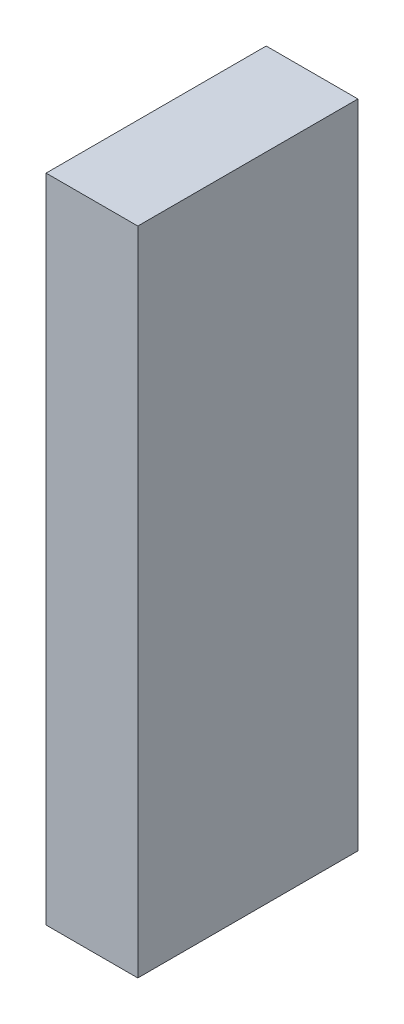
ISO-10303-21;
HEADER;
FILE_DESCRIPTION(('STEP AP214'),'2;1');
FILE_NAME('part.step','',(''),(''),'','','');
FILE_SCHEMA(('AUTOMOTIVE_DESIGN { 1 0 10303 214 1 1 1 1 }'));
ENDSEC;
DATA;
#1=APPLICATION_CONTEXT('core data for automotive mechanical design processes');
#2=APPLICATION_PROTOCOL_DEFINITION('international standard','automotive_design',2000,#1);
#3=PRODUCT_CONTEXT('',#1,'mechanical');
#4=PRODUCT('Part','Part','',(#3));
#5=PRODUCT_RELATED_PRODUCT_CATEGORY('part','',(#4));
#6=PRODUCT_DEFINITION_FORMATION('','',#4);
#7=PRODUCT_DEFINITION_CONTEXT('part definition',#1,'design');
#8=PRODUCT_DEFINITION('design','',#6,#7);
#9=PRODUCT_DEFINITION_SHAPE('','',#8);
#10=(LENGTH_UNIT() NAMED_UNIT(*) SI_UNIT(.MILLI.,.METRE.));
#11=(NAMED_UNIT(*) PLANE_ANGLE_UNIT() SI_UNIT($,.RADIAN.));
#12=(NAMED_UNIT(*) SI_UNIT($,.STERADIAN.) SOLID_ANGLE_UNIT());
#13=UNCERTAINTY_MEASURE_WITH_UNIT(LENGTH_MEASURE(1.E-05),#10,'distance_accuracy_value','');
#14=(GEOMETRIC_REPRESENTATION_CONTEXT(3) GLOBAL_UNCERTAINTY_ASSIGNED_CONTEXT((#13)) GLOBAL_UNIT_ASSIGNED_CONTEXT((#10,
#11,#12)) REPRESENTATION_CONTEXT('',''));
#15=CARTESIAN_POINT('',(0.,0.,0.));
#16=DIRECTION('',(0.,0.,1.));
#17=DIRECTION('',(1.,0.,0.));
#18=AXIS2_PLACEMENT_3D('',#15,#16,#17);
#19=CARTESIAN_POINT('',(0.,0.,0.));
#20=DIRECTION('',(-1.,0.,0.));
#21=DIRECTION('',(0.,0.,1.));
#22=AXIS2_PLACEMENT_3D('',#19,#20,#21);
#23=PLANE('',#22);
#24=DIRECTION('',(0.,0.,-1.));
#25=VECTOR('',#24,1.);
#26=CARTESIAN_POINT('',(0.,79.7999999999999,20.5));
#27=LINE('',#26,#25);
#28=CARTESIAN_POINT('',(0.,79.7999999999999,20.5));
#29=VERTEX_POINT('',#28);
#30=CARTESIAN_POINT('',(0.,79.7999999999999,-20.5));
#31=VERTEX_POINT('',#30);
#32=EDGE_CURVE('E55',#29,#31,#27,.T.);
#33=ORIENTED_EDGE('',*,*,#32,.F.);
#34=DIRECTION('',(0.,1.,0.));
#35=VECTOR('',#34,1.);
#36=CARTESIAN_POINT('',(0.,74.5999999999999,20.5));
#37=LINE('',#36,#35);
#38=CARTESIAN_POINT('',(0.,74.5999999999999,20.5));
#39=VERTEX_POINT('',#38);
#40=EDGE_CURVE('E136',#39,#29,#37,.T.);
#41=ORIENTED_EDGE('',*,*,#40,.F.);
#42=DIRECTION('',(0.,0.,1.));
#43=VECTOR('',#42,1.);
#44=CARTESIAN_POINT('',(0.,74.5999999999999,20.5));
#45=LINE('',#44,#43);
#46=CARTESIAN_POINT('',(0.,74.5999999999999,-20.5));
#47=VERTEX_POINT('',#46);
#48=EDGE_CURVE('E139',#47,#39,#45,.T.);
#49=ORIENTED_EDGE('',*,*,#48,.F.);
#50=DIRECTION('',(0.,-1.,0.));
#51=VECTOR('',#50,1.);
#52=CARTESIAN_POINT('',(0.,74.5999999999999,-20.5));
#53=LINE('',#52,#51);
#54=EDGE_CURVE('E145',#31,#47,#53,.T.);
#55=ORIENTED_EDGE('',*,*,#54,.F.);
#56=EDGE_LOOP('',(#33,#41,#49,#55));
#57=FACE_BOUND('',#56,.T.);
#58=CARTESIAN_POINT('',(0.,14.,-13.));
#59=DIRECTION('',(-1.,0.,0.));
#60=DIRECTION('',(0.,0.,1.));
#61=AXIS2_PLACEMENT_3D('',#58,#59,#60);
#62=CIRCLE('',#61,2.6);
#63=CARTESIAN_POINT('',(0.,14.,-10.4));
#64=VERTEX_POINT('',#63);
#65=EDGE_CURVE('E47',#64,#64,#62,.T.);
#66=ORIENTED_EDGE('',*,*,#65,.F.);
#67=EDGE_LOOP('',(#66));
#68=FACE_BOUND('',#67,.T.);
#69=CARTESIAN_POINT('',(0.,-13.9761892483413,-13.));
#70=DIRECTION('',(-1.,0.,0.));
#71=DIRECTION('',(0.,0.,1.));
#72=AXIS2_PLACEMENT_3D('',#69,#70,#71);
#73=CIRCLE('',#72,2.6);
#74=CARTESIAN_POINT('',(0.,-13.9761892483413,-10.4));
#75=VERTEX_POINT('',#74);
#76=EDGE_CURVE('E188',#75,#75,#73,.T.);
#77=ORIENTED_EDGE('',*,*,#76,.F.);
#78=EDGE_LOOP('',(#77));
#79=FACE_BOUND('',#78,.T.);
#80=CARTESIAN_POINT('',(0.,-13.9761892483413,13.));
#81=DIRECTION('',(-1.,0.,0.));
#82=DIRECTION('',(0.,0.,1.));
#83=AXIS2_PLACEMENT_3D('',#80,#81,#82);
#84=CIRCLE('',#83,2.6);
#85=CARTESIAN_POINT('',(0.,-13.9761892483413,15.6));
#86=VERTEX_POINT('',#85);
#87=EDGE_CURVE('E42',#86,#86,#84,.T.);
#88=ORIENTED_EDGE('',*,*,#87,.F.);
#89=EDGE_LOOP('',(#88));
#90=FACE_BOUND('',#89,.T.);
#91=CARTESIAN_POINT('',(0.,14.,13.));
#92=DIRECTION('',(-1.,0.,0.));
#93=DIRECTION('',(0.,0.,1.));
#94=AXIS2_PLACEMENT_3D('',#91,#92,#93);
#95=CIRCLE('',#94,2.6);
#96=CARTESIAN_POINT('',(0.,14.,15.6));
#97=VERTEX_POINT('',#96);
#98=EDGE_CURVE('E178',#97,#97,#95,.T.);
#99=ORIENTED_EDGE('',*,*,#98,.F.);
#100=EDGE_LOOP('',(#99));
#101=FACE_BOUND('',#100,.T.);
#102=DIRECTION('',(0.,0.,1.));
#103=VECTOR('',#102,1.);
#104=CARTESIAN_POINT('',(0.,110.509514535045,24.0000000000001));
#105=LINE('',#104,#103);
#106=CARTESIAN_POINT('',(0.,110.509514535045,-23.9999999999999));
#107=VERTEX_POINT('',#106);
#108=CARTESIAN_POINT('',(0.,110.509514535045,24.0000000000001));
#109=VERTEX_POINT('',#108);
#110=EDGE_CURVE('E169',#107,#109,#105,.T.);
#111=ORIENTED_EDGE('',*,*,#110,.F.);
#112=DIRECTION('',(0.,1.,0.));
#113=VECTOR('',#112,1.);
#114=CARTESIAN_POINT('',(0.,-31.5,-23.9999999999999));
#115=LINE('',#114,#113);
#116=CARTESIAN_POINT('',(0.,-31.5,-23.9999999999999));
#117=VERTEX_POINT('',#116);
#118=EDGE_CURVE('E92',#117,#107,#115,.T.);
#119=ORIENTED_EDGE('',*,*,#118,.F.);
#120=DIRECTION('',(0.,0.,-1.));
#121=VECTOR('',#120,1.);
#122=CARTESIAN_POINT('',(0.,-31.5,24.0000000000001));
#123=LINE('',#122,#121);
#124=CARTESIAN_POINT('',(0.,-31.5,24.0000000000001));
#125=VERTEX_POINT('',#124);
#126=EDGE_CURVE('E165',#125,#117,#123,.T.);
#127=ORIENTED_EDGE('',*,*,#126,.F.);
#128=DIRECTION('',(0.,-1.,0.));
#129=VECTOR('',#128,1.);
#130=CARTESIAN_POINT('',(0.,-31.5,24.0000000000001));
#131=LINE('',#130,#129);
#132=EDGE_CURVE('E64',#109,#125,#131,.T.);
#133=ORIENTED_EDGE('',*,*,#132,.F.);
#134=EDGE_LOOP('',(#111,#119,#127,#133));
#135=FACE_BOUND('',#134,.T.);
#136=ADVANCED_FACE('F39',(#57,#68,#79,#90,#101,#135),#23,.T.);
#137=CARTESIAN_POINT('',(16.,14.,-13.));
#138=DIRECTION('',(-1.,0.,0.));
#139=DIRECTION('',(0.,0.,1.));
#140=AXIS2_PLACEMENT_3D('',#137,#138,#139);
#141=PLANE('',#140);
#142=CARTESIAN_POINT('',(16.,14.,-13.));
#143=DIRECTION('',(-1.,0.,0.));
#144=DIRECTION('',(0.,0.,1.));
#145=AXIS2_PLACEMENT_3D('',#142,#143,#144);
#146=CIRCLE('',#145,2.6);
#147=CARTESIAN_POINT('',(16.,14.,-10.4));
#148=VERTEX_POINT('',#147);
#149=EDGE_CURVE('E11',#148,#148,#146,.T.);
#150=ORIENTED_EDGE('',*,*,#149,.T.);
#151=EDGE_LOOP('',(#150));
#152=FACE_BOUND('',#151,.T.);
#153=ADVANCED_FACE('F201',(#152),#141,.T.);
#154=CARTESIAN_POINT('',(16.,14.,-13.));
#155=DIRECTION('',(-1.,0.,0.));
#156=DIRECTION('',(0.,0.,1.));
#157=AXIS2_PLACEMENT_3D('',#154,#155,#156);
#158=CYLINDRICAL_SURFACE('',#157,2.6);
#159=ORIENTED_EDGE('',*,*,#149,.F.);
#160=EDGE_LOOP('',(#159));
#161=FACE_BOUND('',#160,.T.);
#162=ORIENTED_EDGE('',*,*,#65,.T.);
#163=EDGE_LOOP('',(#162));
#164=FACE_BOUND('',#163,.T.);
#165=ADVANCED_FACE('F228',(#161,#164),#158,.F.);
#166=CARTESIAN_POINT('',(16.,-13.9761892483413,-13.));
#167=DIRECTION('',(-1.,0.,0.));
#168=DIRECTION('',(0.,0.,1.));
#169=AXIS2_PLACEMENT_3D('',#166,#167,#168);
#170=PLANE('',#169);
#171=CARTESIAN_POINT('',(16.,-13.9761892483413,-13.));
#172=DIRECTION('',(-1.,0.,0.));
#173=DIRECTION('',(0.,0.,1.));
#174=AXIS2_PLACEMENT_3D('',#171,#172,#173);
#175=CIRCLE('',#174,2.6);
#176=CARTESIAN_POINT('',(16.,-13.9761892483413,-10.4));
#177=VERTEX_POINT('',#176);
#178=EDGE_CURVE('E185',#177,#177,#175,.T.);
#179=ORIENTED_EDGE('',*,*,#178,.T.);
#180=EDGE_LOOP('',(#179));
#181=FACE_BOUND('',#180,.T.);
#182=ADVANCED_FACE('F235',(#181),#170,.T.);
#183=CARTESIAN_POINT('',(16.,-13.9761892483413,-13.));
#184=DIRECTION('',(-1.,0.,0.));
#185=DIRECTION('',(0.,0.,1.));
#186=AXIS2_PLACEMENT_3D('',#183,#184,#185);
#187=CYLINDRICAL_SURFACE('',#186,2.6);
#188=ORIENTED_EDGE('',*,*,#178,.F.);
#189=EDGE_LOOP('',(#188));
#190=FACE_BOUND('',#189,.T.);
#191=ORIENTED_EDGE('',*,*,#76,.T.);
#192=EDGE_LOOP('',(#191));
#193=FACE_BOUND('',#192,.T.);
#194=ADVANCED_FACE('F244',(#190,#193),#187,.F.);
#195=CARTESIAN_POINT('',(16.,-13.9761892483413,13.));
#196=DIRECTION('',(-1.,0.,0.));
#197=DIRECTION('',(0.,0.,1.));
#198=AXIS2_PLACEMENT_3D('',#195,#196,#197);
#199=PLANE('',#198);
#200=CARTESIAN_POINT('',(16.,-13.9761892483413,13.));
#201=DIRECTION('',(-1.,0.,0.));
#202=DIRECTION('',(0.,0.,1.));
#203=AXIS2_PLACEMENT_3D('',#200,#201,#202);
#204=CIRCLE('',#203,2.6);
#205=CARTESIAN_POINT('',(16.,-13.9761892483413,15.6));
#206=VERTEX_POINT('',#205);
#207=EDGE_CURVE('E190',#206,#206,#204,.T.);
#208=ORIENTED_EDGE('',*,*,#207,.T.);
#209=EDGE_LOOP('',(#208));
#210=FACE_BOUND('',#209,.T.);
#211=ADVANCED_FACE('F248',(#210),#199,.T.);
#212=CARTESIAN_POINT('',(16.,-13.9761892483413,13.));
#213=DIRECTION('',(-1.,0.,0.));
#214=DIRECTION('',(0.,0.,1.));
#215=AXIS2_PLACEMENT_3D('',#212,#213,#214);
#216=CYLINDRICAL_SURFACE('',#215,2.6);
#217=ORIENTED_EDGE('',*,*,#207,.F.);
#218=EDGE_LOOP('',(#217));
#219=FACE_BOUND('',#218,.T.);
#220=ORIENTED_EDGE('',*,*,#87,.T.);
#221=EDGE_LOOP('',(#220));
#222=FACE_BOUND('',#221,.T.);
#223=ADVANCED_FACE('F197',(#219,#222),#216,.F.);
#224=CARTESIAN_POINT('',(16.,14.,13.));
#225=DIRECTION('',(-1.,0.,0.));
#226=DIRECTION('',(0.,0.,1.));
#227=AXIS2_PLACEMENT_3D('',#224,#225,#226);
#228=PLANE('',#227);
#229=CARTESIAN_POINT('',(16.,14.,13.));
#230=DIRECTION('',(-1.,0.,0.));
#231=DIRECTION('',(0.,0.,1.));
#232=AXIS2_PLACEMENT_3D('',#229,#230,#231);
#233=CIRCLE('',#232,2.6);
#234=CARTESIAN_POINT('',(16.,14.,15.6));
#235=VERTEX_POINT('',#234);
#236=EDGE_CURVE('E172',#235,#235,#233,.T.);
#237=ORIENTED_EDGE('',*,*,#236,.T.);
#238=EDGE_LOOP('',(#237));
#239=FACE_BOUND('',#238,.T.);
#240=ADVANCED_FACE('F239',(#239),#228,.T.);
#241=CARTESIAN_POINT('',(16.,14.,13.));
#242=DIRECTION('',(-1.,0.,0.));
#243=DIRECTION('',(0.,0.,1.));
#244=AXIS2_PLACEMENT_3D('',#241,#242,#243);
#245=CYLINDRICAL_SURFACE('',#244,2.6);
#246=ORIENTED_EDGE('',*,*,#236,.F.);
#247=EDGE_LOOP('',(#246));
#248=FACE_BOUND('',#247,.T.);
#249=ORIENTED_EDGE('',*,*,#98,.T.);
#250=EDGE_LOOP('',(#249));
#251=FACE_BOUND('',#250,.T.);
#252=ADVANCED_FACE('F225',(#248,#251),#245,.F.);
#253=CARTESIAN_POINT('',(20.,110.509514535045,24.0000000000001));
#254=DIRECTION('',(0.,-1.,0.));
#255=DIRECTION('',(0.,0.,-1.));
#256=AXIS2_PLACEMENT_3D('',#253,#254,#255);
#257=PLANE('',#256);
#258=ORIENTED_EDGE('',*,*,#110,.T.);
#259=DIRECTION('',(-1.,0.,0.));
#260=VECTOR('',#259,1.);
#261=CARTESIAN_POINT('',(20.,110.509514535045,24.0000000000001));
#262=LINE('',#261,#260);
#263=CARTESIAN_POINT('',(20.,110.509514535045,24.0000000000001));
#264=VERTEX_POINT('',#263);
#265=EDGE_CURVE('E151',#264,#109,#262,.T.);
#266=ORIENTED_EDGE('',*,*,#265,.F.);
#267=DIRECTION('',(0.,0.,1.));
#268=VECTOR('',#267,1.);
#269=CARTESIAN_POINT('',(20.,110.509514535045,24.0000000000001));
#270=LINE('',#269,#268);
#271=CARTESIAN_POINT('',(20.,110.509514535045,-23.9999999999999));
#272=VERTEX_POINT('',#271);
#273=EDGE_CURVE('E166',#272,#264,#270,.T.);
#274=ORIENTED_EDGE('',*,*,#273,.F.);
#275=DIRECTION('',(-1.,0.,0.));
#276=VECTOR('',#275,1.);
#277=CARTESIAN_POINT('',(20.,110.509514535045,-23.9999999999999));
#278=LINE('',#277,#276);
#279=EDGE_CURVE('E161',#272,#107,#278,.T.);
#280=ORIENTED_EDGE('',*,*,#279,.T.);
#281=EDGE_LOOP('',(#258,#266,#274,#280));
#282=FACE_BOUND('',#281,.T.);
#283=ADVANCED_FACE('F207',(#282),#257,.F.);
#284=CARTESIAN_POINT('',(20.,-31.5,24.0000000000001));
#285=DIRECTION('',(0.,0.,-1.));
#286=DIRECTION('',(-1.,0.,0.));
#287=AXIS2_PLACEMENT_3D('',#284,#285,#286);
#288=PLANE('',#287);
#289=ORIENTED_EDGE('',*,*,#132,.T.);
#290=DIRECTION('',(-1.,0.,0.));
#291=VECTOR('',#290,1.);
#292=CARTESIAN_POINT('',(20.,-31.5,24.0000000000001));
#293=LINE('',#292,#291);
#294=CARTESIAN_POINT('',(20.,-31.5,24.0000000000001));
#295=VERTEX_POINT('',#294);
#296=EDGE_CURVE('E156',#295,#125,#293,.T.);
#297=ORIENTED_EDGE('',*,*,#296,.F.);
#298=DIRECTION('',(0.,-1.,0.));
#299=VECTOR('',#298,1.);
#300=CARTESIAN_POINT('',(20.,-31.5,24.0000000000001));
#301=LINE('',#300,#299);
#302=EDGE_CURVE('E84',#264,#295,#301,.T.);
#303=ORIENTED_EDGE('',*,*,#302,.F.);
#304=ORIENTED_EDGE('',*,*,#265,.T.);
#305=EDGE_LOOP('',(#289,#297,#303,#304));
#306=FACE_BOUND('',#305,.T.);
#307=ADVANCED_FACE('F216',(#306),#288,.F.);
#308=CARTESIAN_POINT('',(20.,-31.5,24.0000000000001));
#309=DIRECTION('',(0.,1.,0.));
#310=DIRECTION('',(0.,0.,1.));
#311=AXIS2_PLACEMENT_3D('',#308,#309,#310);
#312=PLANE('',#311);
#313=ORIENTED_EDGE('',*,*,#126,.T.);
#314=DIRECTION('',(-1.,0.,0.));
#315=VECTOR('',#314,1.);
#316=CARTESIAN_POINT('',(20.,-31.5,-23.9999999999999));
#317=LINE('',#316,#315);
#318=CARTESIAN_POINT('',(20.,-31.5,-23.9999999999999));
#319=VERTEX_POINT('',#318);
#320=EDGE_CURVE('E159',#319,#117,#317,.T.);
#321=ORIENTED_EDGE('',*,*,#320,.F.);
#322=DIRECTION('',(0.,0.,-1.));
#323=VECTOR('',#322,1.);
#324=CARTESIAN_POINT('',(20.,-31.5,24.0000000000001));
#325=LINE('',#324,#323);
#326=EDGE_CURVE('E174',#295,#319,#325,.T.);
#327=ORIENTED_EDGE('',*,*,#326,.F.);
#328=ORIENTED_EDGE('',*,*,#296,.T.);
#329=EDGE_LOOP('',(#313,#321,#327,#328));
#330=FACE_BOUND('',#329,.T.);
#331=ADVANCED_FACE('F215',(#330),#312,.F.);
#332=CARTESIAN_POINT('',(20.,-31.5,-23.9999999999999));
#333=DIRECTION('',(0.,0.,1.));
#334=DIRECTION('',(1.,0.,0.));
#335=AXIS2_PLACEMENT_3D('',#332,#333,#334);
#336=PLANE('',#335);
#337=ORIENTED_EDGE('',*,*,#118,.T.);
#338=ORIENTED_EDGE('',*,*,#279,.F.);
#339=DIRECTION('',(0.,1.,0.));
#340=VECTOR('',#339,1.);
#341=CARTESIAN_POINT('',(20.,-31.5,-23.9999999999999));
#342=LINE('',#341,#340);
#343=EDGE_CURVE('E163',#319,#272,#342,.T.);
#344=ORIENTED_EDGE('',*,*,#343,.F.);
#345=ORIENTED_EDGE('',*,*,#320,.T.);
#346=EDGE_LOOP('',(#337,#338,#344,#345));
#347=FACE_BOUND('',#346,.T.);
#348=ADVANCED_FACE('F210',(#347),#336,.F.);
#349=CARTESIAN_POINT('',(20.,0.,0.));
#350=DIRECTION('',(1.,0.,0.));
#351=DIRECTION('',(0.,0.,-1.));
#352=AXIS2_PLACEMENT_3D('',#349,#350,#351);
#353=PLANE('',#352);
#354=ORIENTED_EDGE('',*,*,#273,.T.);
#355=ORIENTED_EDGE('',*,*,#302,.T.);
#356=ORIENTED_EDGE('',*,*,#326,.T.);
#357=ORIENTED_EDGE('',*,*,#343,.T.);
#358=EDGE_LOOP('',(#354,#355,#356,#357));
#359=FACE_BOUND('',#358,.T.);
#360=ADVANCED_FACE('F203',(#359),#353,.T.);
#361=CARTESIAN_POINT('',(2.,79.7999999999999,20.5));
#362=DIRECTION('',(0.,1.,0.));
#363=DIRECTION('',(0.,0.,1.));
#364=AXIS2_PLACEMENT_3D('',#361,#362,#363);
#365=PLANE('',#364);
#366=ORIENTED_EDGE('',*,*,#32,.T.);
#367=DIRECTION('',(-1.,0.,0.));
#368=VECTOR('',#367,1.);
#369=CARTESIAN_POINT('',(2.,79.7999999999999,-20.5));
#370=LINE('',#369,#368);
#371=CARTESIAN_POINT('',(2.,79.7999999999999,-20.5));
#372=VERTEX_POINT('',#371);
#373=EDGE_CURVE('E114',#372,#31,#370,.T.);
#374=ORIENTED_EDGE('',*,*,#373,.F.);
#375=DIRECTION('',(0.,0.,-1.));
#376=VECTOR('',#375,1.);
#377=CARTESIAN_POINT('',(2.,79.7999999999999,20.5));
#378=LINE('',#377,#376);
#379=CARTESIAN_POINT('',(2.,79.7999999999999,20.5));
#380=VERTEX_POINT('',#379);
#381=EDGE_CURVE('E118',#380,#372,#378,.T.);
#382=ORIENTED_EDGE('',*,*,#381,.F.);
#383=DIRECTION('',(-1.,0.,0.));
#384=VECTOR('',#383,1.);
#385=CARTESIAN_POINT('',(2.,79.7999999999999,20.5));
#386=LINE('',#385,#384);
#387=EDGE_CURVE('E149',#380,#29,#386,.T.);
#388=ORIENTED_EDGE('',*,*,#387,.T.);
#389=EDGE_LOOP('',(#366,#374,#382,#388));
#390=FACE_BOUND('',#389,.T.);
#391=ADVANCED_FACE('F116',(#390),#365,.F.);
#392=CARTESIAN_POINT('',(2.,74.5999999999999,20.5));
#393=DIRECTION('',(0.,0.,1.));
#394=DIRECTION('',(1.,0.,0.));
#395=AXIS2_PLACEMENT_3D('',#392,#393,#394);
#396=PLANE('',#395);
#397=ORIENTED_EDGE('',*,*,#40,.T.);
#398=ORIENTED_EDGE('',*,*,#387,.F.);
#399=DIRECTION('',(0.,1.,0.));
#400=VECTOR('',#399,1.);
#401=CARTESIAN_POINT('',(2.,74.5999999999999,20.5));
#402=LINE('',#401,#400);
#403=CARTESIAN_POINT('',(2.,74.5999999999999,20.5));
#404=VERTEX_POINT('',#403);
#405=EDGE_CURVE('E124',#404,#380,#402,.T.);
#406=ORIENTED_EDGE('',*,*,#405,.F.);
#407=DIRECTION('',(-1.,0.,0.));
#408=VECTOR('',#407,1.);
#409=CARTESIAN_POINT('',(2.,74.5999999999999,20.5));
#410=LINE('',#409,#408);
#411=EDGE_CURVE('E152',#404,#39,#410,.T.);
#412=ORIENTED_EDGE('',*,*,#411,.T.);
#413=EDGE_LOOP('',(#397,#398,#406,#412));
#414=FACE_BOUND('',#413,.T.);
#415=ADVANCED_FACE('F290',(#414),#396,.F.);
#416=CARTESIAN_POINT('',(2.,74.5999999999999,20.5));
#417=DIRECTION('',(0.,-1.,0.));
#418=DIRECTION('',(0.,0.,-1.));
#419=AXIS2_PLACEMENT_3D('',#416,#417,#418);
#420=PLANE('',#419);
#421=ORIENTED_EDGE('',*,*,#48,.T.);
#422=ORIENTED_EDGE('',*,*,#411,.F.);
#423=DIRECTION('',(0.,0.,1.));
#424=VECTOR('',#423,1.);
#425=CARTESIAN_POINT('',(2.,74.5999999999999,20.5));
#426=LINE('',#425,#424);
#427=CARTESIAN_POINT('',(2.,74.5999999999999,-20.5));
#428=VERTEX_POINT('',#427);
#429=EDGE_CURVE('E132',#428,#404,#426,.T.);
#430=ORIENTED_EDGE('',*,*,#429,.F.);
#431=DIRECTION('',(-1.,0.,0.));
#432=VECTOR('',#431,1.);
#433=CARTESIAN_POINT('',(2.,74.5999999999999,-20.5));
#434=LINE('',#433,#432);
#435=EDGE_CURVE('E123',#428,#47,#434,.T.);
#436=ORIENTED_EDGE('',*,*,#435,.T.);
#437=EDGE_LOOP('',(#421,#422,#430,#436));
#438=FACE_BOUND('',#437,.T.);
#439=ADVANCED_FACE('F298',(#438),#420,.F.);
#440=CARTESIAN_POINT('',(2.,74.5999999999999,-20.5));
#441=DIRECTION('',(0.,0.,-1.));
#442=DIRECTION('',(-1.,0.,0.));
#443=AXIS2_PLACEMENT_3D('',#440,#441,#442);
#444=PLANE('',#443);
#445=ORIENTED_EDGE('',*,*,#54,.T.);
#446=ORIENTED_EDGE('',*,*,#435,.F.);
#447=DIRECTION('',(0.,-1.,0.));
#448=VECTOR('',#447,1.);
#449=CARTESIAN_POINT('',(2.,74.5999999999999,-20.5));
#450=LINE('',#449,#448);
#451=EDGE_CURVE('E127',#372,#428,#450,.T.);
#452=ORIENTED_EDGE('',*,*,#451,.F.);
#453=ORIENTED_EDGE('',*,*,#373,.T.);
#454=EDGE_LOOP('',(#445,#446,#452,#453));
#455=FACE_BOUND('',#454,.T.);
#456=ADVANCED_FACE('F128',(#455),#444,.F.);
#457=CARTESIAN_POINT('',(2.,0.,0.));
#458=DIRECTION('',(1.,0.,0.));
#459=DIRECTION('',(0.,0.,-1.));
#460=AXIS2_PLACEMENT_3D('',#457,#458,#459);
#461=PLANE('',#460);
#462=ORIENTED_EDGE('',*,*,#381,.T.);
#463=ORIENTED_EDGE('',*,*,#451,.T.);
#464=ORIENTED_EDGE('',*,*,#429,.T.);
#465=ORIENTED_EDGE('',*,*,#405,.T.);
#466=EDGE_LOOP('',(#462,#463,#464,#465));
#467=FACE_BOUND('',#466,.T.);
#468=ADVANCED_FACE('F134',(#467),#461,.F.);
#469=CLOSED_SHELL('',(#136,#153,#165,#182,#194,#211,#223,#240,#252,#283,#307,#331,#348,#360,
#391,#415,#439,#456,#468));
#470=MANIFOLD_SOLID_BREP('B2',#469);
#471=ADVANCED_BREP_SHAPE_REPRESENTATION('',(#18,#470),#14);
#472=SHAPE_DEFINITION_REPRESENTATION(#9,#471);
ENDSEC;
END-ISO-10303-21;
